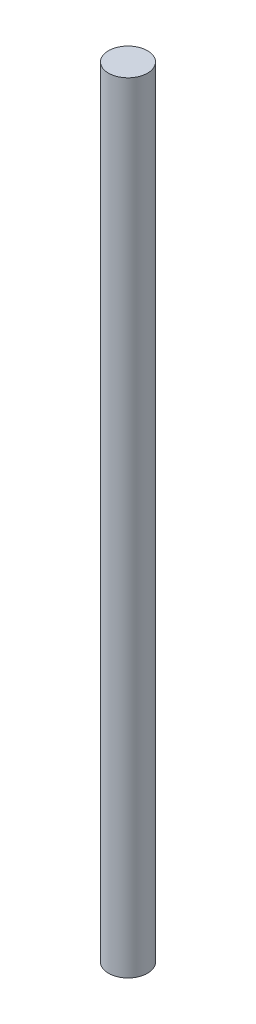
ISO-10303-21;
HEADER;
FILE_DESCRIPTION(('STEP AP214'),'2;1');
FILE_NAME('part.step','',(''),(''),'','','');
FILE_SCHEMA(('AUTOMOTIVE_DESIGN { 1 0 10303 214 1 1 1 1 }'));
ENDSEC;
DATA;
#1=APPLICATION_CONTEXT('core data for automotive mechanical design processes');
#2=APPLICATION_PROTOCOL_DEFINITION('international standard','automotive_design',2000,#1);
#3=PRODUCT_CONTEXT('',#1,'mechanical');
#4=PRODUCT('Part','Part','',(#3));
#5=PRODUCT_RELATED_PRODUCT_CATEGORY('part','',(#4));
#6=PRODUCT_DEFINITION_FORMATION('','',#4);
#7=PRODUCT_DEFINITION_CONTEXT('part definition',#1,'design');
#8=PRODUCT_DEFINITION('design','',#6,#7);
#9=PRODUCT_DEFINITION_SHAPE('','',#8);
#10=(LENGTH_UNIT() NAMED_UNIT(*) SI_UNIT(.MILLI.,.METRE.));
#11=(NAMED_UNIT(*) PLANE_ANGLE_UNIT() SI_UNIT($,.RADIAN.));
#12=(NAMED_UNIT(*) SI_UNIT($,.STERADIAN.) SOLID_ANGLE_UNIT());
#13=UNCERTAINTY_MEASURE_WITH_UNIT(LENGTH_MEASURE(1.E-05),#10,'distance_accuracy_value','');
#14=(GEOMETRIC_REPRESENTATION_CONTEXT(3) GLOBAL_UNCERTAINTY_ASSIGNED_CONTEXT((#13)) GLOBAL_UNIT_ASSIGNED_CONTEXT((#10,
#11,#12)) REPRESENTATION_CONTEXT('',''));
#15=CARTESIAN_POINT('',(0.,0.,0.));
#16=DIRECTION('',(0.,0.,1.));
#17=DIRECTION('',(1.,0.,0.));
#18=AXIS2_PLACEMENT_3D('',#15,#16,#17);
#19=CARTESIAN_POINT('',(0.,127.,0.));
#20=DIRECTION('',(0.,-1.,0.));
#21=DIRECTION('',(0.,0.,-1.));
#22=AXIS2_PLACEMENT_3D('',#19,#20,#21);
#23=CYLINDRICAL_SURFACE('',#22,3.175);
#24=CARTESIAN_POINT('',(0.,127.,0.));
#25=DIRECTION('',(0.,1.,0.));
#26=DIRECTION('',(0.,0.,1.));
#27=AXIS2_PLACEMENT_3D('',#24,#25,#26);
#28=CIRCLE('',#27,3.175);
#29=CARTESIAN_POINT('',(0.,127.,3.175));
#30=VERTEX_POINT('',#29);
#31=EDGE_CURVE('E10',#30,#30,#28,.T.);
#32=ORIENTED_EDGE('',*,*,#31,.F.);
#33=EDGE_LOOP('',(#32));
#34=FACE_BOUND('',#33,.T.);
#35=CARTESIAN_POINT('',(0.,0.,0.));
#36=DIRECTION('',(0.,1.,0.));
#37=DIRECTION('',(0.,0.,1.));
#38=AXIS2_PLACEMENT_3D('',#35,#36,#37);
#39=CIRCLE('',#38,3.175);
#40=CARTESIAN_POINT('',(0.,0.,3.175));
#41=VERTEX_POINT('',#40);
#42=EDGE_CURVE('E34',#41,#41,#39,.T.);
#43=ORIENTED_EDGE('',*,*,#42,.T.);
#44=EDGE_LOOP('',(#43));
#45=FACE_BOUND('',#44,.T.);
#46=ADVANCED_FACE('F31',(#34,#45),#23,.T.);
#47=CARTESIAN_POINT('',(0.,127.,0.));
#48=DIRECTION('',(0.,1.,0.));
#49=DIRECTION('',(0.,0.,1.));
#50=AXIS2_PLACEMENT_3D('',#47,#48,#49);
#51=PLANE('',#50);
#52=ORIENTED_EDGE('',*,*,#31,.T.);
#53=EDGE_LOOP('',(#52));
#54=FACE_BOUND('',#53,.T.);
#55=ADVANCED_FACE('F46',(#54),#51,.T.);
#56=CARTESIAN_POINT('',(0.,0.,0.));
#57=DIRECTION('',(0.,1.,0.));
#58=DIRECTION('',(0.,0.,1.));
#59=AXIS2_PLACEMENT_3D('',#56,#57,#58);
#60=PLANE('',#59);
#61=ORIENTED_EDGE('',*,*,#42,.F.);
#62=EDGE_LOOP('',(#61));
#63=FACE_BOUND('',#62,.T.);
#64=ADVANCED_FACE('F44',(#63),#60,.F.);
#65=CLOSED_SHELL('',(#46,#55,#64));
#66=MANIFOLD_SOLID_BREP('B2',#65);
#67=ADVANCED_BREP_SHAPE_REPRESENTATION('',(#18,#66),#14);
#68=SHAPE_DEFINITION_REPRESENTATION(#9,#67);
ENDSEC;
END-ISO-10303-21;
